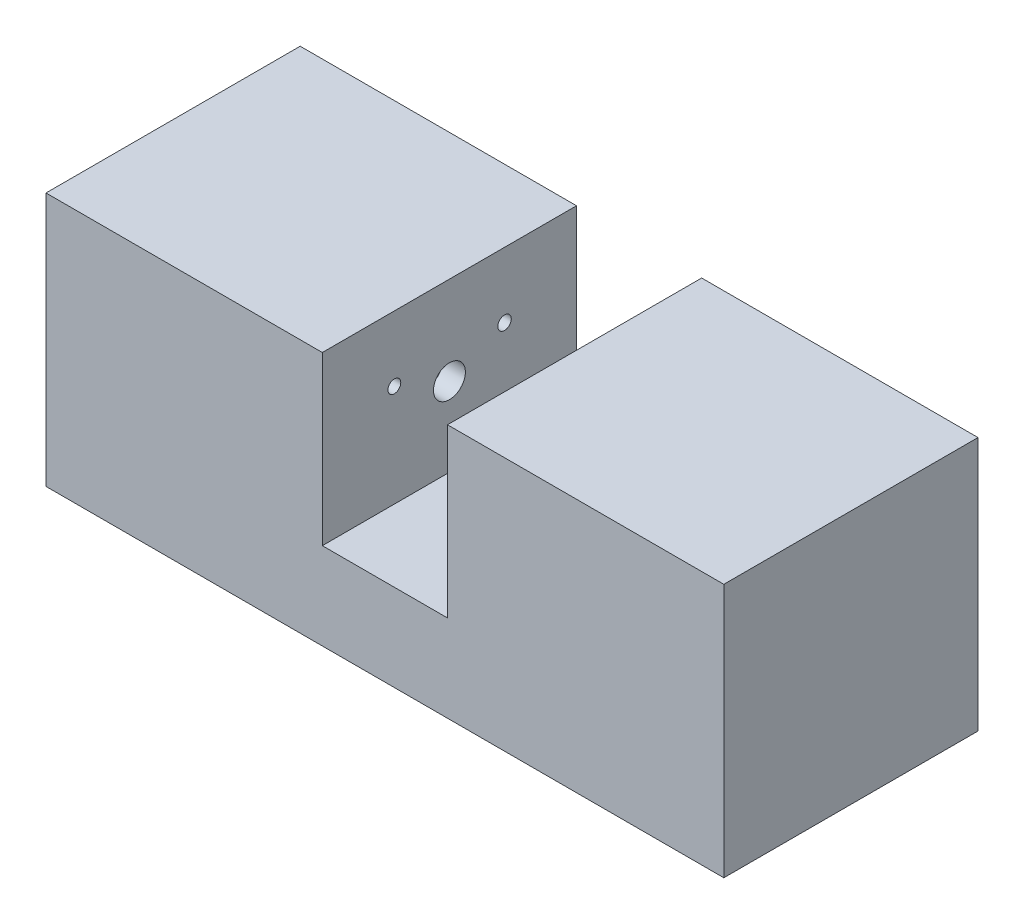
ISO-10303-21;
HEADER;
FILE_DESCRIPTION(('STEP AP214'),'2;1');
FILE_NAME('part.step','',(''),(''),'','','');
FILE_SCHEMA(('AUTOMOTIVE_DESIGN { 1 0 10303 214 1 1 1 1 }'));
ENDSEC;
DATA;
#1=APPLICATION_CONTEXT('core data for automotive mechanical design processes');
#2=APPLICATION_PROTOCOL_DEFINITION('international standard','automotive_design',2000,#1);
#3=PRODUCT_CONTEXT('',#1,'mechanical');
#4=PRODUCT('Part','Part','',(#3));
#5=PRODUCT_RELATED_PRODUCT_CATEGORY('part','',(#4));
#6=PRODUCT_DEFINITION_FORMATION('','',#4);
#7=PRODUCT_DEFINITION_CONTEXT('part definition',#1,'design');
#8=PRODUCT_DEFINITION('design','',#6,#7);
#9=PRODUCT_DEFINITION_SHAPE('','',#8);
#10=(LENGTH_UNIT() NAMED_UNIT(*) SI_UNIT(.MILLI.,.METRE.));
#11=(NAMED_UNIT(*) PLANE_ANGLE_UNIT() SI_UNIT($,.RADIAN.));
#12=(NAMED_UNIT(*) SI_UNIT($,.STERADIAN.) SOLID_ANGLE_UNIT());
#13=UNCERTAINTY_MEASURE_WITH_UNIT(LENGTH_MEASURE(1.E-05),#10,'distance_accuracy_value','');
#14=(GEOMETRIC_REPRESENTATION_CONTEXT(3) GLOBAL_UNCERTAINTY_ASSIGNED_CONTEXT((#13)) GLOBAL_UNIT_ASSIGNED_CONTEXT((#10,
#11,#12)) REPRESENTATION_CONTEXT('',''));
#15=CARTESIAN_POINT('',(0.,0.,0.));
#16=DIRECTION('',(0.,0.,1.));
#17=DIRECTION('',(1.,0.,0.));
#18=AXIS2_PLACEMENT_3D('',#15,#16,#17);
#19=CARTESIAN_POINT('',(40.,15.,15.));
#20=DIRECTION('',(0.,-1.,0.));
#21=DIRECTION('',(0.,0.,-1.));
#22=AXIS2_PLACEMENT_3D('',#19,#20,#21);
#23=PLANE('',#22);
#24=DIRECTION('',(-1.,0.,0.));
#25=VECTOR('',#24,1.);
#26=CARTESIAN_POINT('',(40.,15.,15.));
#27=LINE('',#26,#25);
#28=CARTESIAN_POINT('',(-7.38621056578292,15.,15.));
#29=VERTEX_POINT('',#28);
#30=CARTESIAN_POINT('',(-40.,15.,15.));
#31=VERTEX_POINT('',#30);
#32=EDGE_CURVE('E205',#29,#31,#27,.T.);
#33=ORIENTED_EDGE('',*,*,#32,.F.);
#34=DIRECTION('',(0.,0.,-1.));
#35=VECTOR('',#34,1.);
#36=CARTESIAN_POINT('',(-7.38621056578292,15.,15.));
#37=LINE('',#36,#35);
#38=CARTESIAN_POINT('',(-7.38621056578292,15.,-15.));
#39=VERTEX_POINT('',#38);
#40=EDGE_CURVE('E177',#29,#39,#37,.T.);
#41=ORIENTED_EDGE('',*,*,#40,.T.);
#42=DIRECTION('',(-1.,0.,0.));
#43=VECTOR('',#42,1.);
#44=CARTESIAN_POINT('',(40.,15.,-15.));
#45=LINE('',#44,#43);
#46=CARTESIAN_POINT('',(-40.,15.,-15.));
#47=VERTEX_POINT('',#46);
#48=EDGE_CURVE('E209',#39,#47,#45,.T.);
#49=ORIENTED_EDGE('',*,*,#48,.T.);
#50=DIRECTION('',(0.,0.,1.));
#51=VECTOR('',#50,1.);
#52=CARTESIAN_POINT('',(-40.,15.,15.));
#53=LINE('',#52,#51);
#54=EDGE_CURVE('E194',#47,#31,#53,.T.);
#55=ORIENTED_EDGE('',*,*,#54,.T.);
#56=EDGE_LOOP('',(#33,#41,#49,#55));
#57=FACE_BOUND('',#56,.T.);
#58=ADVANCED_FACE('F33',(#57),#23,.F.);
#59=CARTESIAN_POINT('',(40.,15.,-15.));
#60=DIRECTION('',(0.,0.,1.));
#61=DIRECTION('',(0.,-1.,0.));
#62=AXIS2_PLACEMENT_3D('',#59,#60,#61);
#63=PLANE('',#62);
#64=CARTESIAN_POINT('',(-30.,3.,-15.));
#65=DIRECTION('',(0.,0.,1.));
#66=DIRECTION('',(1.,0.,0.));
#67=AXIS2_PLACEMENT_3D('',#64,#65,#66);
#68=CIRCLE('',#67,5.);
#69=CARTESIAN_POINT('',(-25.,3.,-15.));
#70=VERTEX_POINT('',#69);
#71=EDGE_CURVE('E551',#70,#70,#68,.T.);
#72=ORIENTED_EDGE('',*,*,#71,.T.);
#73=EDGE_LOOP('',(#72));
#74=FACE_BOUND('',#73,.T.);
#75=CARTESIAN_POINT('',(30.,3.,-15.));
#76=DIRECTION('',(0.,0.,1.));
#77=DIRECTION('',(0.,-1.,0.));
#78=AXIS2_PLACEMENT_3D('',#75,#76,#77);
#79=CIRCLE('',#78,5.);
#80=CARTESIAN_POINT('',(30.,-2.,-15.));
#81=VERTEX_POINT('',#80);
#82=EDGE_CURVE('E41',#81,#81,#79,.F.);
#83=ORIENTED_EDGE('',*,*,#82,.F.);
#84=EDGE_LOOP('',(#83));
#85=FACE_BOUND('',#84,.T.);
#86=ORIENTED_EDGE('',*,*,#48,.F.);
#87=DIRECTION('',(0.,1.,0.));
#88=VECTOR('',#87,1.);
#89=CARTESIAN_POINT('',(-7.38621056578292,57.087295004129,-15.));
#90=LINE('',#89,#88);
#91=CARTESIAN_POINT('',(-7.38621056578292,-4.74588957788313,-15.));
#92=VERTEX_POINT('',#91);
#93=EDGE_CURVE('E161',#92,#39,#90,.T.);
#94=ORIENTED_EDGE('',*,*,#93,.F.);
#95=DIRECTION('',(-1.,0.,0.));
#96=VECTOR('',#95,1.);
#97=CARTESIAN_POINT('',(7.38621056578293,-4.74588957788313,-15.));
#98=LINE('',#97,#96);
#99=CARTESIAN_POINT('',(7.38621056578293,-4.74588957788313,-15.));
#100=VERTEX_POINT('',#99);
#101=EDGE_CURVE('E168',#100,#92,#98,.T.);
#102=ORIENTED_EDGE('',*,*,#101,.F.);
#103=DIRECTION('',(0.,-1.,0.));
#104=VECTOR('',#103,1.);
#105=CARTESIAN_POINT('',(7.38621056578293,57.087295004129,-15.));
#106=LINE('',#105,#104);
#107=CARTESIAN_POINT('',(7.38621056578293,15.,-15.));
#108=VERTEX_POINT('',#107);
#109=EDGE_CURVE('E166',#108,#100,#106,.T.);
#110=ORIENTED_EDGE('',*,*,#109,.F.);
#111=CARTESIAN_POINT('',(40.,15.,-15.));
#112=VERTEX_POINT('',#111);
#113=EDGE_CURVE('E210',#112,#108,#45,.T.);
#114=ORIENTED_EDGE('',*,*,#113,.F.);
#115=DIRECTION('',(0.,1.,0.));
#116=VECTOR('',#115,1.);
#117=CARTESIAN_POINT('',(40.,15.,-15.));
#118=LINE('',#117,#116);
#119=CARTESIAN_POINT('',(40.,-15.,-15.));
#120=VERTEX_POINT('',#119);
#121=EDGE_CURVE('E181',#120,#112,#118,.T.);
#122=ORIENTED_EDGE('',*,*,#121,.F.);
#123=DIRECTION('',(-1.,0.,0.));
#124=VECTOR('',#123,1.);
#125=CARTESIAN_POINT('',(40.,-15.,-15.));
#126=LINE('',#125,#124);
#127=CARTESIAN_POINT('',(-40.,-15.,-15.));
#128=VERTEX_POINT('',#127);
#129=EDGE_CURVE('E191',#120,#128,#126,.T.);
#130=ORIENTED_EDGE('',*,*,#129,.T.);
#131=DIRECTION('',(0.,1.,0.));
#132=VECTOR('',#131,1.);
#133=CARTESIAN_POINT('',(-40.,15.,-15.));
#134=LINE('',#133,#132);
#135=EDGE_CURVE('E180',#128,#47,#134,.T.);
#136=ORIENTED_EDGE('',*,*,#135,.T.);
#137=EDGE_LOOP('',(#86,#94,#102,#110,#114,#122,#130,#136));
#138=FACE_BOUND('',#137,.T.);
#139=ADVANCED_FACE('F35',(#74,#85,#138),#63,.F.);
#140=ORIENTED_EDGE('',*,*,#113,.T.);
#141=DIRECTION('',(0.,0.,1.));
#142=VECTOR('',#141,1.);
#143=CARTESIAN_POINT('',(7.38621056578293,15.,15.));
#144=LINE('',#143,#142);
#145=CARTESIAN_POINT('',(7.38621056578293,15.,15.));
#146=VERTEX_POINT('',#145);
#147=EDGE_CURVE('E173',#108,#146,#144,.T.);
#148=ORIENTED_EDGE('',*,*,#147,.T.);
#149=CARTESIAN_POINT('',(40.,15.,15.));
#150=VERTEX_POINT('',#149);
#151=EDGE_CURVE('E206',#150,#146,#27,.T.);
#152=ORIENTED_EDGE('',*,*,#151,.F.);
#153=DIRECTION('',(0.,0.,1.));
#154=VECTOR('',#153,1.);
#155=CARTESIAN_POINT('',(40.,15.,15.));
#156=LINE('',#155,#154);
#157=EDGE_CURVE('E184',#112,#150,#156,.T.);
#158=ORIENTED_EDGE('',*,*,#157,.F.);
#159=EDGE_LOOP('',(#140,#148,#152,#158));
#160=FACE_BOUND('',#159,.T.);
#161=ADVANCED_FACE('F239',(#160),#23,.F.);
#162=CARTESIAN_POINT('',(40.,15.,15.));
#163=DIRECTION('',(0.,0.,-1.));
#164=DIRECTION('',(0.,1.,0.));
#165=AXIS2_PLACEMENT_3D('',#162,#163,#164);
#166=PLANE('',#165);
#167=DIRECTION('',(-1.,0.,0.));
#168=VECTOR('',#167,1.);
#169=CARTESIAN_POINT('',(40.,-4.74588957788313,15.));
#170=LINE('',#169,#168);
#171=CARTESIAN_POINT('',(7.38621056578293,-4.74588957788313,15.));
#172=VERTEX_POINT('',#171);
#173=CARTESIAN_POINT('',(-7.38621056578292,-4.74588957788313,15.0000000000001));
#174=VERTEX_POINT('',#173);
#175=EDGE_CURVE('E216',#172,#174,#170,.T.);
#176=ORIENTED_EDGE('',*,*,#175,.T.);
#177=DIRECTION('',(0.,1.,0.));
#178=VECTOR('',#177,1.);
#179=CARTESIAN_POINT('',(-7.38621056578292,15.,15.));
#180=LINE('',#179,#178);
#181=EDGE_CURVE('E219',#174,#29,#180,.T.);
#182=ORIENTED_EDGE('',*,*,#181,.T.);
#183=ORIENTED_EDGE('',*,*,#32,.T.);
#184=DIRECTION('',(0.,-1.,0.));
#185=VECTOR('',#184,1.);
#186=CARTESIAN_POINT('',(-40.,15.,15.));
#187=LINE('',#186,#185);
#188=CARTESIAN_POINT('',(-40.,-15.,15.));
#189=VERTEX_POINT('',#188);
#190=EDGE_CURVE('E197',#31,#189,#187,.T.);
#191=ORIENTED_EDGE('',*,*,#190,.T.);
#192=DIRECTION('',(-1.,0.,0.));
#193=VECTOR('',#192,1.);
#194=CARTESIAN_POINT('',(40.,-15.,15.));
#195=LINE('',#194,#193);
#196=CARTESIAN_POINT('',(40.,-15.,15.));
#197=VERTEX_POINT('',#196);
#198=EDGE_CURVE('E202',#197,#189,#195,.T.);
#199=ORIENTED_EDGE('',*,*,#198,.F.);
#200=DIRECTION('',(0.,-1.,0.));
#201=VECTOR('',#200,1.);
#202=CARTESIAN_POINT('',(40.,15.,15.));
#203=LINE('',#202,#201);
#204=EDGE_CURVE('E187',#150,#197,#203,.T.);
#205=ORIENTED_EDGE('',*,*,#204,.F.);
#206=ORIENTED_EDGE('',*,*,#151,.T.);
#207=DIRECTION('',(0.,-1.,0.));
#208=VECTOR('',#207,1.);
#209=CARTESIAN_POINT('',(7.38621056578293,15.,15.));
#210=LINE('',#209,#208);
#211=EDGE_CURVE('E213',#146,#172,#210,.T.);
#212=ORIENTED_EDGE('',*,*,#211,.T.);
#213=EDGE_LOOP('',(#176,#182,#183,#191,#199,#205,#206,#212));
#214=FACE_BOUND('',#213,.T.);
#215=ADVANCED_FACE('F256',(#214),#166,.F.);
#216=CARTESIAN_POINT('',(40.,-15.,15.));
#217=DIRECTION('',(0.,1.,0.));
#218=DIRECTION('',(0.,0.,1.));
#219=AXIS2_PLACEMENT_3D('',#216,#217,#218);
#220=PLANE('',#219);
#221=DIRECTION('',(0.,0.,-1.));
#222=VECTOR('',#221,1.);
#223=CARTESIAN_POINT('',(-40.,-15.,15.));
#224=LINE('',#223,#222);
#225=EDGE_CURVE('E185',#189,#128,#224,.T.);
#226=ORIENTED_EDGE('',*,*,#225,.T.);
#227=ORIENTED_EDGE('',*,*,#129,.F.);
#228=DIRECTION('',(0.,0.,-1.));
#229=VECTOR('',#228,1.);
#230=CARTESIAN_POINT('',(40.,-15.,15.));
#231=LINE('',#230,#229);
#232=EDGE_CURVE('E189',#197,#120,#231,.T.);
#233=ORIENTED_EDGE('',*,*,#232,.F.);
#234=ORIENTED_EDGE('',*,*,#198,.T.);
#235=EDGE_LOOP('',(#226,#227,#233,#234));
#236=FACE_BOUND('',#235,.T.);
#237=ADVANCED_FACE('F260',(#236),#220,.F.);
#238=CARTESIAN_POINT('',(40.,0.,0.));
#239=DIRECTION('',(1.,0.,0.));
#240=DIRECTION('',(0.,0.,-1.));
#241=AXIS2_PLACEMENT_3D('',#238,#239,#240);
#242=PLANE('',#241);
#243=ORIENTED_EDGE('',*,*,#121,.T.);
#244=ORIENTED_EDGE('',*,*,#157,.T.);
#245=ORIENTED_EDGE('',*,*,#204,.T.);
#246=ORIENTED_EDGE('',*,*,#232,.T.);
#247=EDGE_LOOP('',(#243,#244,#245,#246));
#248=FACE_BOUND('',#247,.T.);
#249=ADVANCED_FACE('F264',(#248),#242,.T.);
#250=CARTESIAN_POINT('',(-40.,0.,0.));
#251=DIRECTION('',(1.,0.,0.));
#252=DIRECTION('',(0.,0.,-1.));
#253=AXIS2_PLACEMENT_3D('',#250,#251,#252);
#254=PLANE('',#253);
#255=DIRECTION('',(0.,0.,-1.));
#256=VECTOR('',#255,1.);
#257=CARTESIAN_POINT('',(-40.,12.9236427679409,-11.3925385740714));
#258=LINE('',#257,#256);
#259=CARTESIAN_POINT('',(-40.,12.9236427679409,11.3925385740714));
#260=VERTEX_POINT('',#259);
#261=CARTESIAN_POINT('',(-40.,12.9236427679409,-11.3925385740714));
#262=VERTEX_POINT('',#261);
#263=EDGE_CURVE('E154',#260,#262,#258,.T.);
#264=ORIENTED_EDGE('',*,*,#263,.F.);
#265=DIRECTION('',(0.,1.,0.));
#266=VECTOR('',#265,1.);
#267=CARTESIAN_POINT('',(-40.,12.9236427679409,11.3925385740714));
#268=LINE('',#267,#266);
#269=CARTESIAN_POINT('',(-40.,-12.9236427679409,11.3925385740714));
#270=VERTEX_POINT('',#269);
#271=EDGE_CURVE('E48',#270,#260,#268,.T.);
#272=ORIENTED_EDGE('',*,*,#271,.F.);
#273=DIRECTION('',(0.,0.,1.));
#274=VECTOR('',#273,1.);
#275=CARTESIAN_POINT('',(-40.,-12.9236427679409,-11.3925385740714));
#276=LINE('',#275,#274);
#277=CARTESIAN_POINT('',(-40.,-12.9236427679409,-11.3925385740714));
#278=VERTEX_POINT('',#277);
#279=EDGE_CURVE('E142',#278,#270,#276,.T.);
#280=ORIENTED_EDGE('',*,*,#279,.F.);
#281=DIRECTION('',(0.,-1.,0.));
#282=VECTOR('',#281,1.);
#283=CARTESIAN_POINT('',(-40.,12.9236427679409,-11.3925385740714));
#284=LINE('',#283,#282);
#285=EDGE_CURVE('E145',#262,#278,#284,.T.);
#286=ORIENTED_EDGE('',*,*,#285,.F.);
#287=EDGE_LOOP('',(#264,#272,#280,#286));
#288=FACE_BOUND('',#287,.T.);
#289=ORIENTED_EDGE('',*,*,#135,.F.);
#290=ORIENTED_EDGE('',*,*,#225,.F.);
#291=ORIENTED_EDGE('',*,*,#190,.F.);
#292=ORIENTED_EDGE('',*,*,#54,.F.);
#293=EDGE_LOOP('',(#289,#290,#291,#292));
#294=FACE_BOUND('',#293,.T.);
#295=ADVANCED_FACE('F252',(#288,#294),#254,.F.);
#296=CARTESIAN_POINT('',(-7.38621056578292,57.087295004129,165.));
#297=DIRECTION('',(-1.,0.,0.));
#298=DIRECTION('',(0.,0.,1.));
#299=AXIS2_PLACEMENT_3D('',#296,#297,#298);
#300=PLANE('',#299);
#301=CARTESIAN_POINT('',(-7.38621056578292,4.56487450995269,0.));
#302=DIRECTION('',(-1.,0.,0.));
#303=DIRECTION('',(0.,0.,1.));
#304=AXIS2_PLACEMENT_3D('',#301,#302,#303);
#305=CIRCLE('',#304,1.8861792746666);
#306=CARTESIAN_POINT('',(-7.38621056578292,4.56487450995269,1.8861792746666));
#307=VERTEX_POINT('',#306);
#308=EDGE_CURVE('E577',#307,#307,#305,.T.);
#309=ORIENTED_EDGE('',*,*,#308,.T.);
#310=EDGE_LOOP('',(#309));
#311=FACE_BOUND('',#310,.T.);
#312=CARTESIAN_POINT('',(-7.38621056578292,7.29217482179369,6.50191048632367));
#313=DIRECTION('',(1.,0.,0.));
#314=DIRECTION('',(0.,0.,-1.));
#315=AXIS2_PLACEMENT_3D('',#312,#313,#314);
#316=CIRCLE('',#315,0.758797673116242);
#317=CARTESIAN_POINT('',(-7.38621056578292,7.29217482179369,5.74311281320743));
#318=VERTEX_POINT('',#317);
#319=EDGE_CURVE('E580',#318,#318,#316,.T.);
#320=ORIENTED_EDGE('',*,*,#319,.F.);
#321=EDGE_LOOP('',(#320));
#322=FACE_BOUND('',#321,.T.);
#323=CARTESIAN_POINT('',(-7.38621056578292,7.29217482179369,-6.50604962424057));
#324=DIRECTION('',(1.,0.,0.));
#325=DIRECTION('',(0.,0.,-1.));
#326=AXIS2_PLACEMENT_3D('',#323,#324,#325);
#327=CIRCLE('',#326,0.794930895645592);
#328=CARTESIAN_POINT('',(-7.38621056578292,7.29217482179369,-7.30098051988616));
#329=VERTEX_POINT('',#328);
#330=EDGE_CURVE('E148',#329,#329,#327,.T.);
#331=ORIENTED_EDGE('',*,*,#330,.F.);
#332=EDGE_LOOP('',(#331));
#333=FACE_BOUND('',#332,.T.);
#334=ORIENTED_EDGE('',*,*,#181,.F.);
#335=DIRECTION('',(0.,0.,-1.));
#336=VECTOR('',#335,1.);
#337=CARTESIAN_POINT('',(-7.38621056578292,-4.74588957788313,165.));
#338=LINE('',#337,#336);
#339=EDGE_CURVE('E171',#174,#92,#338,.T.);
#340=ORIENTED_EDGE('',*,*,#339,.T.);
#341=ORIENTED_EDGE('',*,*,#93,.T.);
#342=ORIENTED_EDGE('',*,*,#40,.F.);
#343=EDGE_LOOP('',(#334,#340,#341,#342));
#344=FACE_BOUND('',#343,.T.);
#345=ADVANCED_FACE('F274',(#311,#322,#333,#344),#300,.F.);
#346=CARTESIAN_POINT('',(7.38621056578293,-4.74588957788313,165.));
#347=DIRECTION('',(0.,-1.,0.));
#348=DIRECTION('',(0.,0.,-1.));
#349=AXIS2_PLACEMENT_3D('',#346,#347,#348);
#350=PLANE('',#349);
#351=DIRECTION('',(0.,0.,-1.));
#352=VECTOR('',#351,1.);
#353=CARTESIAN_POINT('',(7.38621056578293,-4.74588957788313,165.));
#354=LINE('',#353,#352);
#355=EDGE_CURVE('E56',#172,#100,#354,.T.);
#356=ORIENTED_EDGE('',*,*,#355,.T.);
#357=ORIENTED_EDGE('',*,*,#101,.T.);
#358=ORIENTED_EDGE('',*,*,#339,.F.);
#359=ORIENTED_EDGE('',*,*,#175,.F.);
#360=EDGE_LOOP('',(#356,#357,#358,#359));
#361=FACE_BOUND('',#360,.T.);
#362=ADVANCED_FACE('F272',(#361),#350,.F.);
#363=CARTESIAN_POINT('',(7.38621056578293,57.087295004129,165.));
#364=DIRECTION('',(1.,0.,0.));
#365=DIRECTION('',(0.,0.,-1.));
#366=AXIS2_PLACEMENT_3D('',#363,#364,#365);
#367=PLANE('',#366);
#368=CARTESIAN_POINT('',(7.38621056578293,4.56487450995269,0.));
#369=DIRECTION('',(1.,0.,0.));
#370=DIRECTION('',(0.,0.,-1.));
#371=AXIS2_PLACEMENT_3D('',#368,#369,#370);
#372=CIRCLE('',#371,1.8861792746666);
#373=CARTESIAN_POINT('',(7.38621056578293,4.56487450995269,-1.8861792746666));
#374=VERTEX_POINT('',#373);
#375=EDGE_CURVE('E572',#374,#374,#372,.T.);
#376=ORIENTED_EDGE('',*,*,#375,.T.);
#377=EDGE_LOOP('',(#376));
#378=FACE_BOUND('',#377,.T.);
#379=ORIENTED_EDGE('',*,*,#109,.T.);
#380=ORIENTED_EDGE('',*,*,#355,.F.);
#381=ORIENTED_EDGE('',*,*,#211,.F.);
#382=ORIENTED_EDGE('',*,*,#147,.F.);
#383=EDGE_LOOP('',(#379,#380,#381,#382));
#384=FACE_BOUND('',#383,.T.);
#385=ADVANCED_FACE('F269',(#378,#384),#367,.F.);
#386=CARTESIAN_POINT('',(-10.,12.9236427679409,11.3925385740714));
#387=DIRECTION('',(0.,0.,1.));
#388=DIRECTION('',(1.,0.,0.));
#389=AXIS2_PLACEMENT_3D('',#386,#387,#388);
#390=PLANE('',#389);
#391=ORIENTED_EDGE('',*,*,#271,.T.);
#392=DIRECTION('',(-1.,0.,0.));
#393=VECTOR('',#392,1.);
#394=CARTESIAN_POINT('',(-10.,12.9236427679409,11.3925385740714));
#395=LINE('',#394,#393);
#396=CARTESIAN_POINT('',(-10.,12.9236427679409,11.3925385740714));
#397=VERTEX_POINT('',#396);
#398=EDGE_CURVE('E120',#397,#260,#395,.T.);
#399=ORIENTED_EDGE('',*,*,#398,.F.);
#400=DIRECTION('',(0.,1.,0.));
#401=VECTOR('',#400,1.);
#402=CARTESIAN_POINT('',(-10.,12.9236427679409,11.3925385740714));
#403=LINE('',#402,#401);
#404=CARTESIAN_POINT('',(-10.,-12.9236427679409,11.3925385740714));
#405=VERTEX_POINT('',#404);
#406=EDGE_CURVE('E124',#405,#397,#403,.T.);
#407=ORIENTED_EDGE('',*,*,#406,.F.);
#408=DIRECTION('',(-1.,0.,0.));
#409=VECTOR('',#408,1.);
#410=CARTESIAN_POINT('',(-10.,-12.9236427679409,11.3925385740714));
#411=LINE('',#410,#409);
#412=EDGE_CURVE('E159',#405,#270,#411,.T.);
#413=ORIENTED_EDGE('',*,*,#412,.T.);
#414=EDGE_LOOP('',(#391,#399,#407,#413));
#415=FACE_BOUND('',#414,.T.);
#416=ADVANCED_FACE('F122',(#415),#390,.F.);
#417=CARTESIAN_POINT('',(-10.,-12.9236427679409,-11.3925385740714));
#418=DIRECTION('',(0.,-1.,0.));
#419=DIRECTION('',(0.,0.,-1.));
#420=AXIS2_PLACEMENT_3D('',#417,#418,#419);
#421=PLANE('',#420);
#422=ORIENTED_EDGE('',*,*,#279,.T.);
#423=ORIENTED_EDGE('',*,*,#412,.F.);
#424=DIRECTION('',(0.,0.,1.));
#425=VECTOR('',#424,1.);
#426=CARTESIAN_POINT('',(-10.,-12.9236427679409,-11.3925385740714));
#427=LINE('',#426,#425);
#428=CARTESIAN_POINT('',(-10.,-12.9236427679409,-11.3925385740714));
#429=VERTEX_POINT('',#428);
#430=EDGE_CURVE('E130',#429,#405,#427,.T.);
#431=ORIENTED_EDGE('',*,*,#430,.F.);
#432=DIRECTION('',(-1.,0.,0.));
#433=VECTOR('',#432,1.);
#434=CARTESIAN_POINT('',(-10.,-12.9236427679409,-11.3925385740714));
#435=LINE('',#434,#433);
#436=EDGE_CURVE('E162',#429,#278,#435,.T.);
#437=ORIENTED_EDGE('',*,*,#436,.T.);
#438=EDGE_LOOP('',(#422,#423,#431,#437));
#439=FACE_BOUND('',#438,.T.);
#440=ADVANCED_FACE('F323',(#439),#421,.F.);
#441=CARTESIAN_POINT('',(-10.,12.9236427679409,-11.3925385740714));
#442=DIRECTION('',(0.,0.,-1.));
#443=DIRECTION('',(-1.,0.,0.));
#444=AXIS2_PLACEMENT_3D('',#441,#442,#443);
#445=PLANE('',#444);
#446=ORIENTED_EDGE('',*,*,#285,.T.);
#447=ORIENTED_EDGE('',*,*,#436,.F.);
#448=DIRECTION('',(0.,-1.,0.));
#449=VECTOR('',#448,1.);
#450=CARTESIAN_POINT('',(-10.,12.9236427679409,-11.3925385740714));
#451=LINE('',#450,#449);
#452=CARTESIAN_POINT('',(-10.,12.9236427679409,-11.3925385740714));
#453=VERTEX_POINT('',#452);
#454=EDGE_CURVE('E138',#453,#429,#451,.T.);
#455=ORIENTED_EDGE('',*,*,#454,.F.);
#456=DIRECTION('',(-1.,0.,0.));
#457=VECTOR('',#456,1.);
#458=CARTESIAN_POINT('',(-10.,12.9236427679409,-11.3925385740714));
#459=LINE('',#458,#457);
#460=EDGE_CURVE('E129',#453,#262,#459,.T.);
#461=ORIENTED_EDGE('',*,*,#460,.T.);
#462=EDGE_LOOP('',(#446,#447,#455,#461));
#463=FACE_BOUND('',#462,.T.);
#464=ADVANCED_FACE('F334',(#463),#445,.F.);
#465=CARTESIAN_POINT('',(-10.,12.9236427679409,-11.3925385740714));
#466=DIRECTION('',(0.,1.,0.));
#467=DIRECTION('',(0.,0.,1.));
#468=AXIS2_PLACEMENT_3D('',#465,#466,#467);
#469=PLANE('',#468);
#470=ORIENTED_EDGE('',*,*,#263,.T.);
#471=ORIENTED_EDGE('',*,*,#460,.F.);
#472=DIRECTION('',(0.,0.,-1.));
#473=VECTOR('',#472,1.);
#474=CARTESIAN_POINT('',(-10.,12.9236427679409,-11.3925385740714));
#475=LINE('',#474,#473);
#476=EDGE_CURVE('E133',#397,#453,#475,.T.);
#477=ORIENTED_EDGE('',*,*,#476,.F.);
#478=ORIENTED_EDGE('',*,*,#398,.T.);
#479=EDGE_LOOP('',(#470,#471,#477,#478));
#480=FACE_BOUND('',#479,.T.);
#481=ADVANCED_FACE('F134',(#480),#469,.F.);
#482=CARTESIAN_POINT('',(-10.,0.,0.));
#483=DIRECTION('',(-1.,0.,0.));
#484=DIRECTION('',(0.,0.,1.));
#485=AXIS2_PLACEMENT_3D('',#482,#483,#484);
#486=PLANE('',#485);
#487=CARTESIAN_POINT('',(-10.,4.56487450995269,0.));
#488=DIRECTION('',(-1.,0.,0.));
#489=DIRECTION('',(0.,0.,1.));
#490=AXIS2_PLACEMENT_3D('',#487,#488,#489);
#491=CIRCLE('',#490,1.8861792746666);
#492=CARTESIAN_POINT('',(-10.,4.56487450995269,1.8861792746666));
#493=VERTEX_POINT('',#492);
#494=EDGE_CURVE('E568',#493,#493,#491,.T.);
#495=ORIENTED_EDGE('',*,*,#494,.F.);
#496=EDGE_LOOP('',(#495));
#497=FACE_BOUND('',#496,.T.);
#498=CARTESIAN_POINT('',(-10.,-9.87110587964523,-6.50604962424057));
#499=DIRECTION('',(-1.,0.,0.));
#500=DIRECTION('',(0.,0.,1.));
#501=AXIS2_PLACEMENT_3D('',#498,#499,#500);
#502=CIRCLE('',#501,0.975597008292316);
#503=CARTESIAN_POINT('',(-10.,-9.87110587964523,-5.53045261594826));
#504=VERTEX_POINT('',#503);
#505=EDGE_CURVE('E155',#504,#504,#502,.T.);
#506=ORIENTED_EDGE('',*,*,#505,.F.);
#507=EDGE_LOOP('',(#506));
#508=FACE_BOUND('',#507,.T.);
#509=CARTESIAN_POINT('',(-10.,-9.65430654446916,6.2851111511476));
#510=DIRECTION('',(-1.,0.,0.));
#511=DIRECTION('',(0.,0.,1.));
#512=AXIS2_PLACEMENT_3D('',#509,#510,#511);
#513=CIRCLE('',#512,1.05345541187175);
#514=CARTESIAN_POINT('',(-10.,-9.65430654446916,7.33856656301935));
#515=VERTEX_POINT('',#514);
#516=EDGE_CURVE('E228',#515,#515,#513,.T.);
#517=ORIENTED_EDGE('',*,*,#516,.F.);
#518=EDGE_LOOP('',(#517));
#519=FACE_BOUND('',#518,.T.);
#520=CARTESIAN_POINT('',(-10.,7.29217482179369,6.50191048632367));
#521=DIRECTION('',(-1.,0.,0.));
#522=DIRECTION('',(0.,0.,1.));
#523=AXIS2_PLACEMENT_3D('',#520,#521,#522);
#524=CIRCLE('',#523,0.758797673116242);
#525=CARTESIAN_POINT('',(-10.,7.29217482179369,7.26070815943991));
#526=VERTEX_POINT('',#525);
#527=EDGE_CURVE('E225',#526,#526,#524,.T.);
#528=ORIENTED_EDGE('',*,*,#527,.F.);
#529=EDGE_LOOP('',(#528));
#530=FACE_BOUND('',#529,.T.);
#531=CARTESIAN_POINT('',(-10.,7.29217482179369,-6.50604962424057));
#532=DIRECTION('',(-1.,0.,0.));
#533=DIRECTION('',(0.,0.,1.));
#534=AXIS2_PLACEMENT_3D('',#531,#532,#533);
#535=CIRCLE('',#534,0.794930895645592);
#536=CARTESIAN_POINT('',(-10.,7.29217482179369,-5.71111872859498));
#537=VERTEX_POINT('',#536);
#538=EDGE_CURVE('E222',#537,#537,#535,.T.);
#539=ORIENTED_EDGE('',*,*,#538,.F.);
#540=EDGE_LOOP('',(#539));
#541=FACE_BOUND('',#540,.T.);
#542=ORIENTED_EDGE('',*,*,#406,.T.);
#543=ORIENTED_EDGE('',*,*,#476,.T.);
#544=ORIENTED_EDGE('',*,*,#454,.T.);
#545=ORIENTED_EDGE('',*,*,#430,.T.);
#546=EDGE_LOOP('',(#542,#543,#544,#545));
#547=FACE_BOUND('',#546,.T.);
#548=ADVANCED_FACE('F140',(#497,#508,#519,#530,#541,#547),#486,.T.);
#549=CARTESIAN_POINT('',(-67.3862105657829,7.29217482179369,-6.50604962424057));
#550=DIRECTION('',(1.,0.,0.));
#551=DIRECTION('',(0.,0.,-1.));
#552=AXIS2_PLACEMENT_3D('',#549,#550,#551);
#553=CYLINDRICAL_SURFACE('',#552,0.794930895645592);
#554=ORIENTED_EDGE('',*,*,#538,.T.);
#555=EDGE_LOOP('',(#554));
#556=FACE_BOUND('',#555,.T.);
#557=ORIENTED_EDGE('',*,*,#330,.T.);
#558=EDGE_LOOP('',(#557));
#559=FACE_BOUND('',#558,.T.);
#560=ADVANCED_FACE('F359',(#556,#559),#553,.F.);
#561=CARTESIAN_POINT('',(-67.3862105657829,7.29217482179369,6.50191048632367));
#562=DIRECTION('',(1.,0.,0.));
#563=DIRECTION('',(0.,0.,-1.));
#564=AXIS2_PLACEMENT_3D('',#561,#562,#563);
#565=CYLINDRICAL_SURFACE('',#564,0.758797673116242);
#566=ORIENTED_EDGE('',*,*,#527,.T.);
#567=EDGE_LOOP('',(#566));
#568=FACE_BOUND('',#567,.T.);
#569=ORIENTED_EDGE('',*,*,#319,.T.);
#570=EDGE_LOOP('',(#569));
#571=FACE_BOUND('',#570,.T.);
#572=ADVANCED_FACE('F364',(#568,#571),#565,.F.);
#573=CARTESIAN_POINT('',(-67.3862105657829,-9.65430654446916,6.2851111511476));
#574=DIRECTION('',(1.,0.,0.));
#575=DIRECTION('',(0.,0.,-1.));
#576=AXIS2_PLACEMENT_3D('',#573,#574,#575);
#577=CYLINDRICAL_SURFACE('',#576,1.05345541187175);
#578=ORIENTED_EDGE('',*,*,#516,.T.);
#579=EDGE_LOOP('',(#578));
#580=FACE_BOUND('',#579,.T.);
#581=CARTESIAN_POINT('',(-7.38621056578292,-9.65430654446916,6.2851111511476));
#582=DIRECTION('',(1.,0.,0.));
#583=DIRECTION('',(0.,0.,-1.));
#584=AXIS2_PLACEMENT_3D('',#581,#582,#583);
#585=CIRCLE('',#584,1.05345541187175);
#586=CARTESIAN_POINT('',(-7.38621056578292,-9.65430654446916,5.23165573927584));
#587=VERTEX_POINT('',#586);
#588=EDGE_CURVE('E583',#587,#587,#585,.T.);
#589=ORIENTED_EDGE('',*,*,#588,.T.);
#590=EDGE_LOOP('',(#589));
#591=FACE_BOUND('',#590,.T.);
#592=ADVANCED_FACE('F374',(#580,#591),#577,.F.);
#593=CARTESIAN_POINT('',(-7.38621056578292,-9.65430654446916,6.2851111511476));
#594=DIRECTION('',(1.,0.,0.));
#595=DIRECTION('',(0.,0.,-1.));
#596=AXIS2_PLACEMENT_3D('',#593,#594,#595);
#597=PLANE('',#596);
#598=ORIENTED_EDGE('',*,*,#588,.F.);
#599=EDGE_LOOP('',(#598));
#600=FACE_BOUND('',#599,.T.);
#601=ADVANCED_FACE('F384',(#600),#597,.F.);
#602=CARTESIAN_POINT('',(-67.3862105657829,-9.87110587964523,-6.50604962424057));
#603=DIRECTION('',(1.,0.,0.));
#604=DIRECTION('',(0.,0.,-1.));
#605=AXIS2_PLACEMENT_3D('',#602,#603,#604);
#606=CYLINDRICAL_SURFACE('',#605,0.975597008292316);
#607=ORIENTED_EDGE('',*,*,#505,.T.);
#608=EDGE_LOOP('',(#607));
#609=FACE_BOUND('',#608,.T.);
#610=CARTESIAN_POINT('',(-7.38621056578292,-9.87110587964523,-6.50604962424057));
#611=DIRECTION('',(1.,0.,0.));
#612=DIRECTION('',(0.,0.,-1.));
#613=AXIS2_PLACEMENT_3D('',#610,#611,#612);
#614=CIRCLE('',#613,0.975597008292316);
#615=CARTESIAN_POINT('',(-7.38621056578292,-9.87110587964523,-7.48164663253289));
#616=VERTEX_POINT('',#615);
#617=EDGE_CURVE('E579',#616,#616,#614,.T.);
#618=ORIENTED_EDGE('',*,*,#617,.T.);
#619=EDGE_LOOP('',(#618));
#620=FACE_BOUND('',#619,.T.);
#621=ADVANCED_FACE('F394',(#609,#620),#606,.F.);
#622=CARTESIAN_POINT('',(-7.38621056578292,-9.87110587964523,-6.50604962424057));
#623=DIRECTION('',(1.,0.,0.));
#624=DIRECTION('',(0.,0.,-1.));
#625=AXIS2_PLACEMENT_3D('',#622,#623,#624);
#626=PLANE('',#625);
#627=ORIENTED_EDGE('',*,*,#617,.F.);
#628=EDGE_LOOP('',(#627));
#629=FACE_BOUND('',#628,.T.);
#630=ADVANCED_FACE('F404',(#629),#626,.F.);
#631=CARTESIAN_POINT('',(20.,4.56487450995269,0.));
#632=DIRECTION('',(-1.,0.,0.));
#633=DIRECTION('',(0.,0.,1.));
#634=AXIS2_PLACEMENT_3D('',#631,#632,#633);
#635=CYLINDRICAL_SURFACE('',#634,1.8861792746666);
#636=ORIENTED_EDGE('',*,*,#494,.T.);
#637=EDGE_LOOP('',(#636));
#638=FACE_BOUND('',#637,.T.);
#639=ORIENTED_EDGE('',*,*,#308,.F.);
#640=EDGE_LOOP('',(#639));
#641=FACE_BOUND('',#640,.T.);
#642=ADVANCED_FACE('F413',(#638,#641),#635,.F.);
#643=CARTESIAN_POINT('',(20.,4.56487450995269,0.));
#644=DIRECTION('',(-1.,0.,0.));
#645=DIRECTION('',(0.,0.,1.));
#646=AXIS2_PLACEMENT_3D('',#643,#644,#645);
#647=CIRCLE('',#646,1.8861792746666);
#648=CARTESIAN_POINT('',(20.,4.56487450995269,1.8861792746666));
#649=VERTEX_POINT('',#648);
#650=EDGE_CURVE('E569',#649,#649,#647,.T.);
#651=ORIENTED_EDGE('',*,*,#650,.F.);
#652=EDGE_LOOP('',(#651));
#653=FACE_BOUND('',#652,.T.);
#654=ORIENTED_EDGE('',*,*,#375,.F.);
#655=EDGE_LOOP('',(#654));
#656=FACE_BOUND('',#655,.T.);
#657=ADVANCED_FACE('F441',(#653,#656),#635,.F.);
#658=CARTESIAN_POINT('',(20.,4.56487450995269,0.));
#659=DIRECTION('',(-1.,0.,0.));
#660=DIRECTION('',(0.,0.,1.));
#661=AXIS2_PLACEMENT_3D('',#658,#659,#660);
#662=PLANE('',#661);
#663=ORIENTED_EDGE('',*,*,#650,.T.);
#664=EDGE_LOOP('',(#663));
#665=FACE_BOUND('',#664,.T.);
#666=ADVANCED_FACE('F451',(#665),#662,.T.);
#667=CARTESIAN_POINT('',(30.,3.,-20.));
#668=DIRECTION('',(0.,0.,-1.));
#669=DIRECTION('',(-1.,0.,0.));
#670=AXIS2_PLACEMENT_3D('',#667,#668,#669);
#671=PLANE('',#670);
#672=CARTESIAN_POINT('',(30.,3.,-20.));
#673=DIRECTION('',(0.,0.,-1.));
#674=DIRECTION('',(-1.,0.,0.));
#675=AXIS2_PLACEMENT_3D('',#672,#673,#674);
#676=CIRCLE('',#675,5.);
#677=CARTESIAN_POINT('',(25.,3.,-20.));
#678=VERTEX_POINT('',#677);
#679=EDGE_CURVE('E563',#678,#678,#676,.T.);
#680=ORIENTED_EDGE('',*,*,#679,.T.);
#681=EDGE_LOOP('',(#680));
#682=FACE_BOUND('',#681,.T.);
#683=CARTESIAN_POINT('',(30.,3.,-20.));
#684=DIRECTION('',(0.,0.,-1.));
#685=DIRECTION('',(-1.,0.,0.));
#686=AXIS2_PLACEMENT_3D('',#683,#684,#685);
#687=CIRCLE('',#686,4.00000000000001);
#688=CARTESIAN_POINT('',(26.,3.,-20.));
#689=VERTEX_POINT('',#688);
#690=EDGE_CURVE('E560',#689,#689,#687,.T.);
#691=ORIENTED_EDGE('',*,*,#690,.F.);
#692=EDGE_LOOP('',(#691));
#693=FACE_BOUND('',#692,.T.);
#694=ADVANCED_FACE('F460',(#682,#693),#671,.T.);
#695=CARTESIAN_POINT('',(30.,3.,-20.));
#696=DIRECTION('',(0.,0.,1.));
#697=DIRECTION('',(1.,0.,0.));
#698=AXIS2_PLACEMENT_3D('',#695,#696,#697);
#699=CYLINDRICAL_SURFACE('',#698,5.);
#700=ORIENTED_EDGE('',*,*,#679,.F.);
#701=EDGE_LOOP('',(#700));
#702=FACE_BOUND('',#701,.T.);
#703=ORIENTED_EDGE('',*,*,#82,.T.);
#704=EDGE_LOOP('',(#703));
#705=FACE_BOUND('',#704,.T.);
#706=ADVANCED_FACE('F235',(#702,#705),#699,.T.);
#707=CARTESIAN_POINT('',(30.,3.,-20.));
#708=DIRECTION('',(0.,0.,1.));
#709=DIRECTION('',(1.,0.,0.));
#710=AXIS2_PLACEMENT_3D('',#707,#708,#709);
#711=CYLINDRICAL_SURFACE('',#710,4.00000000000001);
#712=ORIENTED_EDGE('',*,*,#690,.T.);
#713=EDGE_LOOP('',(#712));
#714=FACE_BOUND('',#713,.T.);
#715=CARTESIAN_POINT('',(30.,3.,-15.));
#716=DIRECTION('',(0.,0.,-1.));
#717=DIRECTION('',(-1.,0.,0.));
#718=AXIS2_PLACEMENT_3D('',#715,#716,#717);
#719=CIRCLE('',#718,4.00000000000001);
#720=CARTESIAN_POINT('',(26.,3.,-15.));
#721=VERTEX_POINT('',#720);
#722=EDGE_CURVE('E558',#721,#721,#719,.T.);
#723=ORIENTED_EDGE('',*,*,#722,.F.);
#724=EDGE_LOOP('',(#723));
#725=FACE_BOUND('',#724,.T.);
#726=ADVANCED_FACE('F480',(#714,#725),#711,.F.);
#727=ORIENTED_EDGE('',*,*,#722,.T.);
#728=EDGE_LOOP('',(#727));
#729=FACE_BOUND('',#728,.T.);
#730=ADVANCED_FACE('F242',(#729),#63,.F.);
#731=CARTESIAN_POINT('',(-30.,3.,-20.));
#732=DIRECTION('',(0.,0.,1.));
#733=DIRECTION('',(1.,0.,0.));
#734=AXIS2_PLACEMENT_3D('',#731,#732,#733);
#735=CYLINDRICAL_SURFACE('',#734,5.);
#736=CARTESIAN_POINT('',(-30.,3.,-20.));
#737=DIRECTION('',(0.,0.,1.));
#738=DIRECTION('',(1.,0.,0.));
#739=AXIS2_PLACEMENT_3D('',#736,#737,#738);
#740=CIRCLE('',#739,5.);
#741=CARTESIAN_POINT('',(-25.,3.,-20.));
#742=VERTEX_POINT('',#741);
#743=EDGE_CURVE('E554',#742,#742,#740,.T.);
#744=ORIENTED_EDGE('',*,*,#743,.T.);
#745=EDGE_LOOP('',(#744));
#746=FACE_BOUND('',#745,.T.);
#747=ORIENTED_EDGE('',*,*,#71,.F.);
#748=EDGE_LOOP('',(#747));
#749=FACE_BOUND('',#748,.T.);
#750=ADVANCED_FACE('F499',(#746,#749),#735,.T.);
#751=CARTESIAN_POINT('',(-30.,3.,-20.));
#752=DIRECTION('',(0.,0.,-1.));
#753=DIRECTION('',(1.,0.,0.));
#754=AXIS2_PLACEMENT_3D('',#751,#752,#753);
#755=PLANE('',#754);
#756=CARTESIAN_POINT('',(-30.,3.,-20.));
#757=DIRECTION('',(0.,0.,1.));
#758=DIRECTION('',(1.,0.,0.));
#759=AXIS2_PLACEMENT_3D('',#756,#757,#758);
#760=CIRCLE('',#759,4.00000000000001);
#761=CARTESIAN_POINT('',(-26.,3.,-20.));
#762=VERTEX_POINT('',#761);
#763=EDGE_CURVE('E550',#762,#762,#760,.T.);
#764=ORIENTED_EDGE('',*,*,#763,.T.);
#765=EDGE_LOOP('',(#764));
#766=FACE_BOUND('',#765,.T.);
#767=ORIENTED_EDGE('',*,*,#743,.F.);
#768=EDGE_LOOP('',(#767));
#769=FACE_BOUND('',#768,.T.);
#770=ADVANCED_FACE('F515',(#766,#769),#755,.T.);
#771=CARTESIAN_POINT('',(-30.,3.,-20.));
#772=DIRECTION('',(0.,0.,1.));
#773=DIRECTION('',(1.,0.,0.));
#774=AXIS2_PLACEMENT_3D('',#771,#772,#773);
#775=CYLINDRICAL_SURFACE('',#774,4.00000000000001);
#776=ORIENTED_EDGE('',*,*,#763,.F.);
#777=EDGE_LOOP('',(#776));
#778=FACE_BOUND('',#777,.T.);
#779=CARTESIAN_POINT('',(-30.,3.,-15.));
#780=DIRECTION('',(0.,0.,1.));
#781=DIRECTION('',(0.,-1.,0.));
#782=AXIS2_PLACEMENT_3D('',#779,#780,#781);
#783=CIRCLE('',#782,4.00000000000001);
#784=CARTESIAN_POINT('',(-30.,-1.00000000000001,-15.));
#785=VERTEX_POINT('',#784);
#786=EDGE_CURVE('E11',#785,#785,#783,.T.);
#787=ORIENTED_EDGE('',*,*,#786,.T.);
#788=EDGE_LOOP('',(#787));
#789=FACE_BOUND('',#788,.T.);
#790=ADVANCED_FACE('F525',(#778,#789),#775,.F.);
#791=ORIENTED_EDGE('',*,*,#786,.F.);
#792=EDGE_LOOP('',(#791));
#793=FACE_BOUND('',#792,.T.);
#794=ADVANCED_FACE('F241',(#793),#63,.F.);
#795=CLOSED_SHELL('',(#58,#139,#161,#215,#237,#249,#295,#345,#362,#385,#416,#440,#464,#481,#548,
#560,#572,#592,#601,#621,#630,#642,#657,#666,#694,#706,#726,#730,#750,#770,#790,#794));
#796=MANIFOLD_SOLID_BREP('B2',#795);
#797=ADVANCED_BREP_SHAPE_REPRESENTATION('',(#18,#796),#14);
#798=SHAPE_DEFINITION_REPRESENTATION(#9,#797);
ENDSEC;
END-ISO-10303-21;
